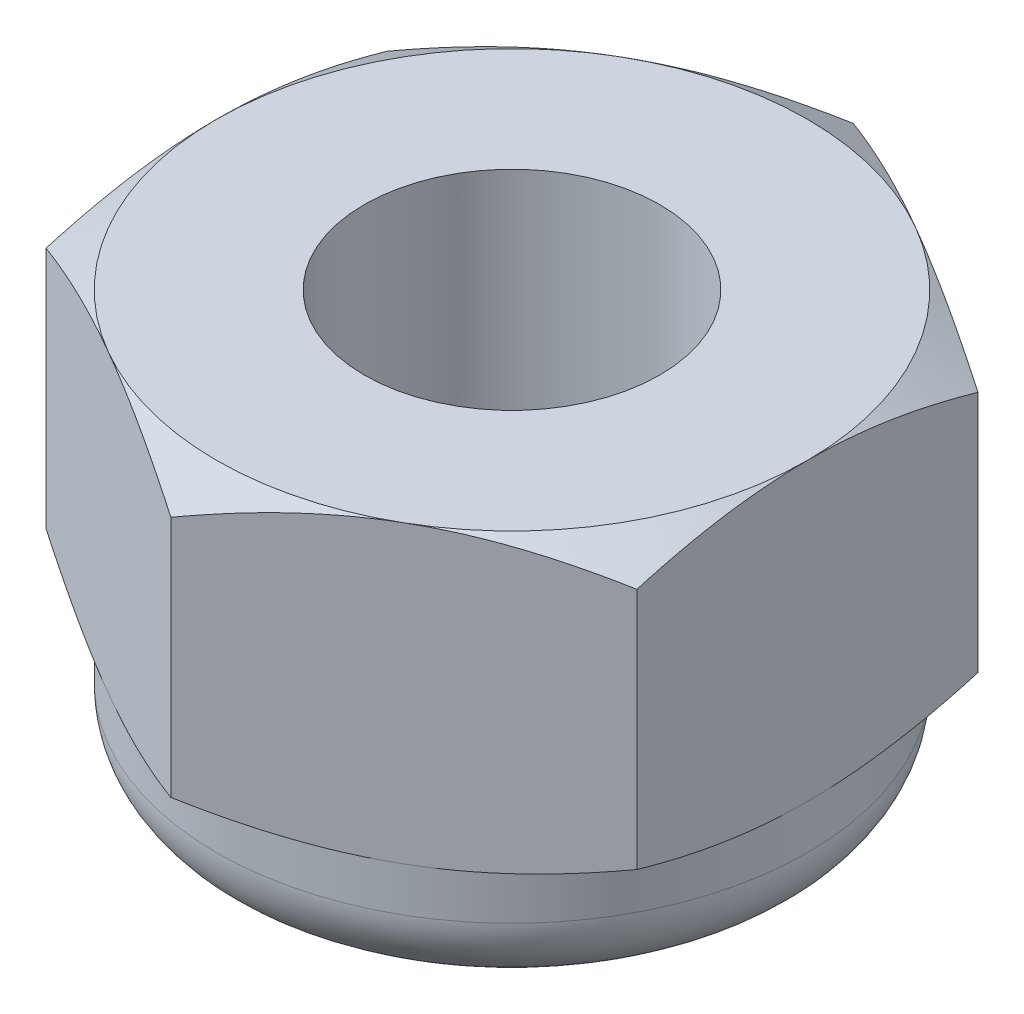
ISO-10303-21;
HEADER;
FILE_DESCRIPTION(('STEP AP214'),'2;1');
FILE_NAME('part.step','',(''),(''),'','','');
FILE_SCHEMA(('AUTOMOTIVE_DESIGN { 1 0 10303 214 1 1 1 1 }'));
ENDSEC;
DATA;
#1=APPLICATION_CONTEXT('core data for automotive mechanical design processes');
#2=APPLICATION_PROTOCOL_DEFINITION('international standard','automotive_design',2000,#1);
#3=PRODUCT_CONTEXT('',#1,'mechanical');
#4=PRODUCT('Part','Part','',(#3));
#5=PRODUCT_RELATED_PRODUCT_CATEGORY('part','',(#4));
#6=PRODUCT_DEFINITION_FORMATION('','',#4);
#7=PRODUCT_DEFINITION_CONTEXT('part definition',#1,'design');
#8=PRODUCT_DEFINITION('design','',#6,#7);
#9=PRODUCT_DEFINITION_SHAPE('','',#8);
#10=(LENGTH_UNIT() NAMED_UNIT(*) SI_UNIT(.MILLI.,.METRE.));
#11=(NAMED_UNIT(*) PLANE_ANGLE_UNIT() SI_UNIT($,.RADIAN.));
#12=(NAMED_UNIT(*) SI_UNIT($,.STERADIAN.) SOLID_ANGLE_UNIT());
#13=UNCERTAINTY_MEASURE_WITH_UNIT(LENGTH_MEASURE(1.E-05),#10,'distance_accuracy_value','');
#14=(GEOMETRIC_REPRESENTATION_CONTEXT(3) GLOBAL_UNCERTAINTY_ASSIGNED_CONTEXT((#13)) GLOBAL_UNIT_ASSIGNED_CONTEXT((#10,
#11,#12)) REPRESENTATION_CONTEXT('',''));
#15=CARTESIAN_POINT('',(0.,0.,0.));
#16=DIRECTION('',(0.,0.,1.));
#17=DIRECTION('',(1.,0.,0.));
#18=AXIS2_PLACEMENT_3D('',#15,#16,#17);
#19=CARTESIAN_POINT('',(2.,2.,1.15470053837925));
#20=DIRECTION('',(-1.,0.,0.));
#21=DIRECTION('',(0.,0.,1.));
#22=AXIS2_PLACEMENT_3D('',#19,#20,#21);
#23=PLANE('',#22);
#24=CARTESIAN_POINT('',(2.,0.978756095407433,-3.10723536680844));
#25=CARTESIAN_POINT('',(2.,0.936330863332912,-3.01982291823219));
#26=CARTESIAN_POINT('',(2.,0.89431086317883,-2.93221037878738));
#27=CARTESIAN_POINT('',(2.,0.811309169030377,-2.75647870840016));
#28=CARTESIAN_POINT('',(2.,0.77032763769453,-2.66835950071652));
#29=CARTESIAN_POINT('',(2.,0.689425807572109,-2.49105688446661));
#30=CARTESIAN_POINT('',(2.,0.649512450329226,-2.40187029759473));
#31=CARTESIAN_POINT('',(2.,0.57131209474233,-2.22278956266895));
#32=CARTESIAN_POINT('',(2.,0.533025019861076,-2.13289544814977));
#33=CARTESIAN_POINT('',(2.,0.457311353038221,-1.94935956345824));
#34=CARTESIAN_POINT('',(2.,0.419951688675203,-1.85569003285613));
#35=CARTESIAN_POINT('',(2.,0.34804642812102,-1.66725722619784));
#36=CARTESIAN_POINT('',(2.,0.313501146844893,-1.57249382909434));
#37=CARTESIAN_POINT('',(2.,0.248127262347396,-1.3818979783052));
#38=CARTESIAN_POINT('',(2.,0.217291190182717,-1.28606811236179));
#39=CARTESIAN_POINT('',(2.,0.16032134999564,-1.09303393169062));
#40=CARTESIAN_POINT('',(2.,0.13418610741452,-0.995830058317725));
#41=CARTESIAN_POINT('',(2.,0.088004663821854,-0.800519631578303));
#42=CARTESIAN_POINT('',(2.,0.0679260461447405,-0.702420887609314));
#43=CARTESIAN_POINT('',(2.,0.0349927806492822,-0.504998657700061));
#44=CARTESIAN_POINT('',(2.,0.0221374160431476,-0.405675294282897));
#45=CARTESIAN_POINT('',(2.,0.00484760332888601,-0.207596358324772));
#46=CARTESIAN_POINT('',(2.,0.000304399832631512,-0.108850556214251));
#47=CARTESIAN_POINT('',(2.,-0.00027499053746382,0.0886636690413114));
#48=CARTESIAN_POINT('',(2.,0.00368903604532294,0.187432092691779));
#49=CARTESIAN_POINT('',(2.,0.0230279822465883,0.42400790895349));
#50=CARTESIAN_POINT('',(2.,0.0423603458166526,0.561494039281412));
#51=CARTESIAN_POINT('',(2.,0.0941420038673285,0.833973970325345));
#52=CARTESIAN_POINT('',(2.,0.126603821944875,0.968965262409071));
#53=CARTESIAN_POINT('',(2.,0.201944047960998,1.23927661564325));
#54=CARTESIAN_POINT('',(2.,0.245044073308442,1.37453334872187));
#55=CARTESIAN_POINT('',(2.,0.314931252126183,1.57552896056492));
#56=CARTESIAN_POINT('',(2.,0.339097251406265,1.6422062420081));
#57=CARTESIAN_POINT('',(2.,0.388899908585125,1.77500960513522));
#58=CARTESIAN_POINT('',(2.,0.414536540528148,1.84113569652374));
#59=CARTESIAN_POINT('',(2.,0.481768746714614,2.0098882556886));
#60=CARTESIAN_POINT('',(2.,0.524243277066455,2.11216361209732));
#61=CARTESIAN_POINT('',(2.,0.611466108883442,2.31574315039746));
#62=CARTESIAN_POINT('',(2.,0.656214597675463,2.41704725145785));
#63=CARTESIAN_POINT('',(2.,0.793084875164524,2.7198353856836));
#64=CARTESIAN_POINT('',(2.,0.887808948992072,2.9201404776794));
#65=CARTESIAN_POINT('',(2.,1.08164958397818,3.31892342337664));
#66=CARTESIAN_POINT('',(2.,1.1807719397507,3.51739842382533));
#67=CARTESIAN_POINT('',(2.,1.38182194200768,3.91287779117342));
#68=CARTESIAN_POINT('',(2.,1.48374912228986,4.10988239563614));
#69=CARTESIAN_POINT('',(2.,1.67962496575455,4.48394528386546));
#70=CARTESIAN_POINT('',(2.,1.77339629287174,4.66109678041009));
#71=CARTESIAN_POINT('',(2.,1.96210959651939,5.01478564385389));
#72=CARTESIAN_POINT('',(2.,2.05705162979441,5.19132298044855));
#73=CARTESIAN_POINT('',(2.,2.24753342574158,5.54340746059359));
#74=CARTESIAN_POINT('',(2.,2.34307063024195,5.71895599016192));
#75=CARTESIAN_POINT('',(2.,2.53482345312968,6.06966713420134));
#76=CARTESIAN_POINT('',(2.,2.63103902598617,6.24482977355625));
#77=CARTESIAN_POINT('',(2.,2.72750366313233,6.41985423406967));
#78=B_SPLINE_CURVE_WITH_KNOTS('',3,(#24,#25,#26,#27,#28,#29,#30,#31,#32,#33,#34,#35,#36,#37,#38,
#39,#40,#41,#42,#43,#44,#45,#46,#47,#48,#49,#50,#51,#52,#53,#54,#55,#56,#57,#58,#59,#60,#61,#62,
#63,#64,#65,#66,#67,#68,#69,#70,#71,#72,#73,#74,#75,#76,#77),.UNSPECIFIED.,.F.,.F.,(4,2,2,2,2,2,
2,2,2,2,2,2,2,2,2,2,2,2,2,2,2,2,2,2,2,2,4),(0.,0.291495438255313,0.583036255581611,
0.876154468393304,1.16925887095091,1.47175908410079,1.77429309911686,2.07620734845282,
2.37802672737343,2.67820079177808,2.97834506363382,3.27453340260849,3.57072917339146,
3.98638730667862,4.40244285615798,4.8280307744903,5.04078368935428,5.25353285041585,
5.58572764769847,5.91794985542651,6.58257182862605,7.24809705005278,7.91351231191618,
8.51482375464892,9.11616445863758,9.71574753203119,10.3152907384778),.UNSPECIFIED.);
#79=CARTESIAN_POINT('',(2.,0.178632794953899,-1.15470053837953));
#80=VERTEX_POINT('',#79);
#81=CARTESIAN_POINT('',(2.,0.,0.));
#82=VERTEX_POINT('',#81);
#83=EDGE_CURVE('E150',#80,#82,#78,.T.);
#84=ORIENTED_EDGE('',*,*,#83,.F.);
#85=DIRECTION('',(0.,-1.,0.));
#86=VECTOR('',#85,1.);
#87=CARTESIAN_POINT('',(2.,2.,-1.15470053837925));
#88=LINE('',#87,#86);
#89=CARTESIAN_POINT('',(2.,1.82136720504592,-1.15470053837925));
#90=VERTEX_POINT('',#89);
#91=EDGE_CURVE('E159',#90,#80,#88,.T.);
#92=ORIENTED_EDGE('',*,*,#91,.F.);
#93=CARTESIAN_POINT('',(2.,1.02124390459258,-3.10723536680844));
#94=CARTESIAN_POINT('',(2.,1.0636691366671,-3.01982291823219));
#95=CARTESIAN_POINT('',(2.,1.10568913682119,-2.93221037878738));
#96=CARTESIAN_POINT('',(2.,1.18869083096964,-2.75647870840016));
#97=CARTESIAN_POINT('',(2.,1.22967236230548,-2.66835950071652));
#98=CARTESIAN_POINT('',(2.,1.3105741924279,-2.49105688446661));
#99=CARTESIAN_POINT('',(2.,1.35048754967079,-2.40187029759472));
#100=CARTESIAN_POINT('',(2.,1.42868790525768,-2.22278956266895));
#101=CARTESIAN_POINT('',(2.,1.46697498013893,-2.13289544814976));
#102=CARTESIAN_POINT('',(2.,1.54268864696179,-1.94935956345823));
#103=CARTESIAN_POINT('',(2.,1.58004831132481,-1.85569003285612));
#104=CARTESIAN_POINT('',(2.,1.65195357187899,-1.66725722619784));
#105=CARTESIAN_POINT('',(2.,1.68649885315511,-1.57249382909433));
#106=CARTESIAN_POINT('',(2.,1.75187273765261,-1.3818979783052));
#107=CARTESIAN_POINT('',(2.,1.78270880981729,-1.28606811236179));
#108=CARTESIAN_POINT('',(2.,1.83967865000436,-1.09303393169062));
#109=CARTESIAN_POINT('',(2.,1.86581389258548,-0.995830058317724));
#110=CARTESIAN_POINT('',(2.,1.91199533617815,-0.800519631578301));
#111=CARTESIAN_POINT('',(2.,1.93207395385526,-0.702420887609313));
#112=CARTESIAN_POINT('',(2.,1.96500721935072,-0.50499865770006));
#113=CARTESIAN_POINT('',(2.,1.97786258395685,-0.405675294282897));
#114=CARTESIAN_POINT('',(2.,1.99515239667111,-0.207596358324772));
#115=CARTESIAN_POINT('',(2.,1.99969560016737,-0.108850556214251));
#116=CARTESIAN_POINT('',(2.,2.00027499053746,0.0886636690413102));
#117=CARTESIAN_POINT('',(2.,1.99631096395468,0.187432092691778));
#118=CARTESIAN_POINT('',(2.,1.97697201775341,0.424007908953491));
#119=CARTESIAN_POINT('',(2.,1.95763965418335,0.561494039281416));
#120=CARTESIAN_POINT('',(2.,1.90585799613267,0.833973970325356));
#121=CARTESIAN_POINT('',(2.,1.87339617805512,0.968965262409084));
#122=CARTESIAN_POINT('',(2.,1.798055952039,1.23927661564327));
#123=CARTESIAN_POINT('',(2.,1.75495592669156,1.37453334872189));
#124=CARTESIAN_POINT('',(2.,1.68506874787381,1.57552896056494));
#125=CARTESIAN_POINT('',(2.,1.66090274859373,1.64220624200813));
#126=CARTESIAN_POINT('',(2.,1.61110009141487,1.77500960513525));
#127=CARTESIAN_POINT('',(2.,1.58546345947185,1.84113569652377));
#128=CARTESIAN_POINT('',(2.,1.51823125328538,2.00988825568864));
#129=CARTESIAN_POINT('',(2.,1.47575672293354,2.11216361209735));
#130=CARTESIAN_POINT('',(2.,1.38853389111655,2.31574315039749));
#131=CARTESIAN_POINT('',(2.,1.34378540232453,2.41704725145788));
#132=CARTESIAN_POINT('',(2.,1.20691512483548,2.71983538568363));
#133=CARTESIAN_POINT('',(2.,1.11219105100793,2.92014047767944));
#134=CARTESIAN_POINT('',(2.,0.918350416021822,3.31892342337667));
#135=CARTESIAN_POINT('',(2.,0.8192280602493,3.51739842382536));
#136=CARTESIAN_POINT('',(2.,0.618178057992325,3.91287779117345));
#137=CARTESIAN_POINT('',(2.,0.516250877710148,4.10988239563617));
#138=CARTESIAN_POINT('',(2.,0.320375034245468,4.48394528386549));
#139=CARTESIAN_POINT('',(2.,0.226603707128277,4.66109678041012));
#140=CARTESIAN_POINT('',(2.,0.0378904034806254,5.01478564385392));
#141=CARTESIAN_POINT('',(2.,-0.0570516297943871,5.19132298044858));
#142=CARTESIAN_POINT('',(2.,-0.247533425741555,5.54340746059362));
#143=CARTESIAN_POINT('',(2.,-0.343070630241926,5.71895599016195));
#144=CARTESIAN_POINT('',(2.,-0.534823453129656,6.06966713420137));
#145=CARTESIAN_POINT('',(2.,-0.631039025986142,6.24482977355628));
#146=CARTESIAN_POINT('',(2.,-0.727503663132301,6.41985423406971));
#147=B_SPLINE_CURVE_WITH_KNOTS('',3,(#93,#94,#95,#96,#97,#98,#99,#100,#101,#102,#103,#104,#105,
#106,#107,#108,#109,#110,#111,#112,#113,#114,#115,#116,#117,#118,#119,#120,#121,#122,#123,#124,
#125,#126,#127,#128,#129,#130,#131,#132,#133,#134,#135,#136,#137,#138,#139,#140,#141,#142,#143,
#144,#145,#146),.UNSPECIFIED.,.F.,.F.,(4,2,2,2,2,2,2,2,2,2,2,2,2,2,2,2,2,2,2,2,2,2,2,2,2,2,4),
(0.,0.291495438255313,0.583036255581611,0.876154468393303,1.16925887095091,1.47175908410079,
1.77429309911686,2.07620734845282,2.37802672737343,2.67820079177807,2.97834506363381,
3.27453340260848,3.57072917339145,3.98638730667862,4.40244285615799,4.82803077449032,
5.0407836893543,5.25353285041588,5.5857276476985,5.91794985542653,6.58257182862607,
7.24809705005279,7.91351231191619,8.51482375464894,9.11616445863759,9.7157475320312,
10.3152907384778),.UNSPECIFIED.);
#148=CARTESIAN_POINT('',(2.,2.,0.));
#149=VERTEX_POINT('',#148);
#150=EDGE_CURVE('E224',#149,#90,#147,.F.);
#151=ORIENTED_EDGE('',*,*,#150,.F.);
#152=CARTESIAN_POINT('',(2.,1.82136720504592,1.15470053837925));
#153=VERTEX_POINT('',#152);
#154=EDGE_CURVE('E231',#153,#149,#147,.F.);
#155=ORIENTED_EDGE('',*,*,#154,.F.);
#156=DIRECTION('',(0.,-1.,0.));
#157=VECTOR('',#156,1.);
#158=CARTESIAN_POINT('',(2.,2.,1.15470053837925));
#159=LINE('',#158,#157);
#160=CARTESIAN_POINT('',(2.,0.178632794954083,1.15470053837925));
#161=VERTEX_POINT('',#160);
#162=EDGE_CURVE('E242',#153,#161,#159,.T.);
#163=ORIENTED_EDGE('',*,*,#162,.T.);
#164=EDGE_CURVE('E214',#82,#161,#78,.T.);
#165=ORIENTED_EDGE('',*,*,#164,.F.);
#166=EDGE_LOOP('',(#84,#92,#151,#155,#163,#165));
#167=FACE_BOUND('',#166,.T.);
#168=ADVANCED_FACE('F38',(#167),#23,.F.);
#169=CARTESIAN_POINT('',(2.,2.,-1.15470053837925));
#170=DIRECTION('',(-0.5,0.,0.866025403784439));
#171=DIRECTION('',(0.866025403784439,0.,0.5));
#172=AXIS2_PLACEMENT_3D('',#169,#170,#171);
#173=PLANE('',#172);
#174=CARTESIAN_POINT('',(-0.000199999999999645,0.1786994666205,-2.30951654681234));
#175=CARTESIAN_POINT('',(0.0876912629000605,0.14938953610068,-2.25877250251758));
#176=CARTESIAN_POINT('',(0.176341194473592,0.122732851980468,-2.20759044065996));
#177=CARTESIAN_POINT('',(0.355176246997803,0.0762024910207222,-2.10433997494456));
#178=CARTESIAN_POINT('',(0.445364546505037,0.0563452763827803,-2.0522697359463));
#179=CARTESIAN_POINT('',(0.624623385763307,0.0254334640232535,-1.94877459684592));
#180=CARTESIAN_POINT('',(0.713666338226305,0.0141731515985319,-1.89736562427197));
#181=CARTESIAN_POINT('',(0.892171397785044,0.000728662594642558,-1.79430568008402));
#182=CARTESIAN_POINT('',(0.981632855703959,-0.00146664504653098,-1.74265508327244));
#183=CARTESIAN_POINT('',(1.1488083535488,0.00309098933064971,-1.64613626458981));
#184=CARTESIAN_POINT('',(1.22654737026578,0.00872487468701545,-1.60125362236173));
#185=CARTESIAN_POINT('',(1.38151891453613,0.0265838952608293,-1.51178075956051));
#186=CARTESIAN_POINT('',(1.4587509057412,0.0388151360234405,-1.46719084864821));
#187=CARTESIAN_POINT('',(1.6140421864822,0.0693934368676112,-1.37753338590959));
#188=CARTESIAN_POINT('',(1.69208181310738,0.0878701670657173,-1.33247718647009));
#189=CARTESIAN_POINT('',(1.84699686569213,0.129805518212857,-1.24303693915875));
#190=CARTESIAN_POINT('',(1.92387427762312,0.153254280492315,-1.1986517446858));
#191=CARTESIAN_POINT('',(2.0002,0.178699466620499,-1.15458506832541));
#192=B_SPLINE_CURVE_WITH_KNOTS('',3,(#174,#175,#176,#177,#178,#179,#180,#181,#182,#183,#184,
#185,#186,#187,#188,#189,#190,#191),.UNSPECIFIED.,.F.,.F.,(4,2,2,2,2,2,2,2,4),(0.,
0.31703182469561,0.634825876346564,0.944753967652636,1.25430138000371,1.52387047293094,
1.79368946861028,2.06949491027634,2.34475850821472),.UNSPECIFIED.);
#193=CARTESIAN_POINT('',(0.,0.178632794954083,-2.3094010767585));
#194=VERTEX_POINT('',#193);
#195=CARTESIAN_POINT('',(1.,0.,-1.73205080756888));
#196=VERTEX_POINT('',#195);
#197=EDGE_CURVE('E137',#194,#196,#192,.T.);
#198=ORIENTED_EDGE('',*,*,#197,.F.);
#199=DIRECTION('',(0.,-1.,0.));
#200=VECTOR('',#199,1.);
#201=CARTESIAN_POINT('',(0.,2.,-2.3094010767585));
#202=LINE('',#201,#200);
#203=CARTESIAN_POINT('',(0.,1.82136720504592,-2.3094010767585));
#204=VERTEX_POINT('',#203);
#205=EDGE_CURVE('E254',#204,#194,#202,.T.);
#206=ORIENTED_EDGE('',*,*,#205,.F.);
#207=CARTESIAN_POINT('',(2.0002,1.8213005333795,-1.15458506832541));
#208=CARTESIAN_POINT('',(1.91230873709994,1.85061046389932,-1.20532911262018));
#209=CARTESIAN_POINT('',(1.82365880552641,1.87726714801953,-1.2565111744778));
#210=CARTESIAN_POINT('',(1.6448237530022,1.92379750897928,-1.35976164019319));
#211=CARTESIAN_POINT('',(1.55463545349496,1.94365472361722,-1.41183187919145));
#212=CARTESIAN_POINT('',(1.37537661423669,1.97456653597675,-1.51532701829183));
#213=CARTESIAN_POINT('',(1.2863336617737,1.98582684840147,-1.56673599086578));
#214=CARTESIAN_POINT('',(1.10782860221496,1.99927133740536,-1.66979593505373));
#215=CARTESIAN_POINT('',(1.01836714429604,2.00146664504653,-1.72144653186531));
#216=CARTESIAN_POINT('',(0.851191646451203,1.99690901066935,-1.81796535054794));
#217=CARTESIAN_POINT('',(0.773452629734217,1.99127512531298,-1.86284799277603));
#218=CARTESIAN_POINT('',(0.618481085463868,1.97341610473917,-1.95232085557725));
#219=CARTESIAN_POINT('',(0.541249094258803,1.96118486397656,-1.99691076648954));
#220=CARTESIAN_POINT('',(0.3859578135178,1.93060656313239,-2.08656822922816));
#221=CARTESIAN_POINT('',(0.307918186892621,1.91212983293428,-2.13162442866767));
#222=CARTESIAN_POINT('',(0.153003134307866,1.87019448178714,-2.221064675979));
#223=CARTESIAN_POINT('',(0.0761257223768802,1.84674571950769,-2.26544987045196));
#224=CARTESIAN_POINT('',(-0.000199999999999858,1.8213005333795,-2.30951654681234));
#225=B_SPLINE_CURVE_WITH_KNOTS('',3,(#207,#208,#209,#210,#211,#212,#213,#214,#215,#216,#217,
#218,#219,#220,#221,#222,#223,#224),.UNSPECIFIED.,.F.,.F.,(4,2,2,2,2,2,2,2,4),(0.,
0.317031824695609,0.634825876346562,0.944753967652634,1.25430138000371,1.52387047293094,
1.79368946861028,2.06949491027634,2.34475850821472),.UNSPECIFIED.);
#226=CARTESIAN_POINT('',(1.,2.,-1.73205080756888));
#227=VERTEX_POINT('',#226);
#228=EDGE_CURVE('E233',#227,#204,#225,.T.);
#229=ORIENTED_EDGE('',*,*,#228,.F.);
#230=EDGE_CURVE('E232',#90,#227,#225,.T.);
#231=ORIENTED_EDGE('',*,*,#230,.F.);
#232=ORIENTED_EDGE('',*,*,#91,.T.);
#233=EDGE_CURVE('E145',#196,#80,#192,.T.);
#234=ORIENTED_EDGE('',*,*,#233,.F.);
#235=EDGE_LOOP('',(#198,#206,#229,#231,#232,#234));
#236=FACE_BOUND('',#235,.T.);
#237=ADVANCED_FACE('F156',(#236),#173,.F.);
#238=CARTESIAN_POINT('',(0.,2.,-2.3094010767585));
#239=DIRECTION('',(0.5,0.,0.866025403784439));
#240=DIRECTION('',(0.866025403784439,0.,-0.5));
#241=AXIS2_PLACEMENT_3D('',#238,#239,#240);
#242=PLANE('',#241);
#243=CARTESIAN_POINT('',(-2.0002,0.1786994666205,-1.15458506832541));
#244=CARTESIAN_POINT('',(-1.91230873709994,0.149389536100681,-1.20532911262018));
#245=CARTESIAN_POINT('',(-1.82365880552641,0.122732851980468,-1.2565111744778));
#246=CARTESIAN_POINT('',(-1.6448237530022,0.0762024910207224,-1.35976164019319));
#247=CARTESIAN_POINT('',(-1.55463545349496,0.0563452763827804,-1.41183187919145));
#248=CARTESIAN_POINT('',(-1.37537661423669,0.0254334640232536,-1.51532701829183));
#249=CARTESIAN_POINT('',(-1.2863336617737,0.0141731515985321,-1.56673599086578));
#250=CARTESIAN_POINT('',(-1.10782860221496,0.000728662594642656,-1.66979593505373));
#251=CARTESIAN_POINT('',(-1.01836714429604,-0.00146664504653101,-1.72144653186531));
#252=CARTESIAN_POINT('',(-0.851191646451201,0.00309098933064974,-1.81796535054794));
#253=CARTESIAN_POINT('',(-0.773452629734215,0.00872487468701564,-1.86284799277603));
#254=CARTESIAN_POINT('',(-0.618481085463866,0.0265838952608296,-1.95232085557725));
#255=CARTESIAN_POINT('',(-0.541249094258801,0.0388151360234406,-1.99691076648954));
#256=CARTESIAN_POINT('',(-0.385957813517798,0.0693934368676112,-2.08656822922816));
#257=CARTESIAN_POINT('',(-0.30791818689262,0.0878701670657173,-2.13162442866767));
#258=CARTESIAN_POINT('',(-0.153003134307865,0.129805518212858,-2.221064675979));
#259=CARTESIAN_POINT('',(-0.0761257223768792,0.153254280492315,-2.26544987045196));
#260=CARTESIAN_POINT('',(0.000200000000000784,0.1786994666205,-2.30951654681234));
#261=B_SPLINE_CURVE_WITH_KNOTS('',3,(#243,#244,#245,#246,#247,#248,#249,#250,#251,#252,#253,
#254,#255,#256,#257,#258,#259,#260),.UNSPECIFIED.,.F.,.F.,(4,2,2,2,2,2,2,2,4),(0.,
0.31703182469561,0.634825876346564,0.944753967652637,1.25430138000371,1.52387047293094,
1.79368946861028,2.06949491027634,2.34475850821472),.UNSPECIFIED.);
#262=CARTESIAN_POINT('',(-2.,0.178632794953899,-1.15470053837953));
#263=VERTEX_POINT('',#262);
#264=CARTESIAN_POINT('',(-0.999999999999999,0.,-1.73205080756888));
#265=VERTEX_POINT('',#264);
#266=EDGE_CURVE('E311',#263,#265,#261,.T.);
#267=ORIENTED_EDGE('',*,*,#266,.F.);
#268=DIRECTION('',(0.,-1.,0.));
#269=VECTOR('',#268,1.);
#270=CARTESIAN_POINT('',(-2.,2.,-1.15470053837925));
#271=LINE('',#270,#269);
#272=CARTESIAN_POINT('',(-2.,1.8213672050461,-1.15470053837953));
#273=VERTEX_POINT('',#272);
#274=EDGE_CURVE('E251',#273,#263,#271,.T.);
#275=ORIENTED_EDGE('',*,*,#274,.F.);
#276=CARTESIAN_POINT('',(0.000200000000000387,1.8213005333795,-2.30951654681234));
#277=CARTESIAN_POINT('',(-0.0876912629000595,1.85061046389932,-2.25877250251758));
#278=CARTESIAN_POINT('',(-0.176341194473591,1.87726714801953,-2.20759044065996));
#279=CARTESIAN_POINT('',(-0.355176246997801,1.92379750897928,-2.10433997494456));
#280=CARTESIAN_POINT('',(-0.445364546505036,1.94365472361722,-2.05226973594631));
#281=CARTESIAN_POINT('',(-0.624623385763305,1.97456653597675,-1.94877459684592));
#282=CARTESIAN_POINT('',(-0.713666338226303,1.98582684840147,-1.89736562427197));
#283=CARTESIAN_POINT('',(-0.892171397785042,1.99927133740536,-1.79430568008402));
#284=CARTESIAN_POINT('',(-0.981632855703957,2.00146664504653,-1.74265508327244));
#285=CARTESIAN_POINT('',(-1.1488083535488,1.99690901066935,-1.64613626458981));
#286=CARTESIAN_POINT('',(-1.22654737026578,1.99127512531299,-1.60125362236173));
#287=CARTESIAN_POINT('',(-1.38151891453613,1.97341610473917,-1.51178075956051));
#288=CARTESIAN_POINT('',(-1.4587509057412,1.96118486397656,-1.46719084864821));
#289=CARTESIAN_POINT('',(-1.6140421864822,1.93060656313239,-1.37753338590959));
#290=CARTESIAN_POINT('',(-1.69208181310738,1.91212983293428,-1.33247718647009));
#291=CARTESIAN_POINT('',(-1.84699686569213,1.87019448178714,-1.24303693915875));
#292=CARTESIAN_POINT('',(-1.92387427762312,1.84674571950769,-1.1986517446858));
#293=CARTESIAN_POINT('',(-2.0002,1.8213005333795,-1.15458506832541));
#294=B_SPLINE_CURVE_WITH_KNOTS('',3,(#276,#277,#278,#279,#280,#281,#282,#283,#284,#285,#286,
#287,#288,#289,#290,#291,#292,#293),.UNSPECIFIED.,.F.,.F.,(4,2,2,2,2,2,2,2,4),(0.,
0.317031824695609,0.634825876346563,0.944753967652634,1.25430138000371,1.52387047293094,
1.79368946861028,2.06949491027634,2.34475850821472),.UNSPECIFIED.);
#295=CARTESIAN_POINT('',(-1.,2.,-1.73205080756888));
#296=VERTEX_POINT('',#295);
#297=EDGE_CURVE('E293',#296,#273,#294,.T.);
#298=ORIENTED_EDGE('',*,*,#297,.F.);
#299=EDGE_CURVE('E298',#204,#296,#294,.T.);
#300=ORIENTED_EDGE('',*,*,#299,.F.);
#301=ORIENTED_EDGE('',*,*,#205,.T.);
#302=EDGE_CURVE('E139',#265,#194,#261,.T.);
#303=ORIENTED_EDGE('',*,*,#302,.F.);
#304=EDGE_LOOP('',(#267,#275,#298,#300,#301,#303));
#305=FACE_BOUND('',#304,.T.);
#306=ADVANCED_FACE('F299',(#305),#242,.F.);
#307=CARTESIAN_POINT('',(-2.,2.,-1.15470053837925));
#308=DIRECTION('',(1.,0.,0.));
#309=DIRECTION('',(0.,0.,-1.));
#310=AXIS2_PLACEMENT_3D('',#307,#308,#309);
#311=PLANE('',#310);
#312=CARTESIAN_POINT('',(-2.,0.97875609535379,-3.10723536669795));
#313=CARTESIAN_POINT('',(-2.,0.936330863281514,-3.01982291812541));
#314=CARTESIAN_POINT('',(-2.,0.894310863129675,-2.93221037868432));
#315=CARTESIAN_POINT('',(-2.,0.811309168985699,-2.75647870830454));
#316=CARTESIAN_POINT('',(-2.,0.770327637652085,-2.66835950062463));
#317=CARTESIAN_POINT('',(-2.,0.689425807534132,-2.49105688438224));
#318=CARTESIAN_POINT('',(-2.,0.649512450293482,-2.40187029751414));
#319=CARTESIAN_POINT('',(-2.,0.571312094711017,-2.22278956259597));
#320=CARTESIAN_POINT('',(-2.,0.533025019831961,-2.1328954480806));
#321=CARTESIAN_POINT('',(-2.,0.457311353013554,-1.94935956339698));
#322=CARTESIAN_POINT('',(-2.,0.419951688652782,-1.85569003279897));
#323=CARTESIAN_POINT('',(-2.,0.348046428102969,-1.66725722614894));
#324=CARTESIAN_POINT('',(-2.,0.313501146828967,-1.5724938290496));
#325=CARTESIAN_POINT('',(-2.,0.248127262335514,-1.38189797826887));
#326=CARTESIAN_POINT('',(-2.,0.217291190172755,-1.2860681123297));
#327=CARTESIAN_POINT('',(-2.,0.160321349989199,-1.09303393166713));
#328=CARTESIAN_POINT('',(-2.,0.13418610740968,-0.995830058298589));
#329=CARTESIAN_POINT('',(-2.,0.0880046638202398,-0.800519631570149));
#330=CARTESIAN_POINT('',(-2.,0.0679260461446231,-0.702420887607818));
#331=CARTESIAN_POINT('',(-2.,0.0349927806511484,-0.504998657712037));
#332=CARTESIAN_POINT('',(-2.,0.0221374160455017,-0.405675294301687));
#333=CARTESIAN_POINT('',(-2.,0.00484760333100355,-0.207596358357075));
#334=CARTESIAN_POINT('',(-2.,0.000304399834046624,-0.108850556253253));
#335=CARTESIAN_POINT('',(-2.,-0.000274990538612278,0.0886636689890198));
#336=CARTESIAN_POINT('',(-2.,0.00368903604231298,0.187432092632897));
#337=CARTESIAN_POINT('',(-2.,0.0230279822384204,0.424007908884414));
#338=CARTESIAN_POINT('',(-2.,0.0423603458053599,0.561494039208797));
#339=CARTESIAN_POINT('',(-2.,0.0941420038497061,0.833973970245913));
#340=CARTESIAN_POINT('',(-2.,0.126603821924048,0.968965262326359));
#341=CARTESIAN_POINT('',(-2.,0.201944047933828,1.23927661555394));
#342=CARTESIAN_POINT('',(-2.,0.245044073278133,1.37453334862926));
#343=CARTESIAN_POINT('',(-2.,0.314931252091323,1.57552896046736));
#344=CARTESIAN_POINT('',(-2.,0.339097251369916,1.64220624190891));
#345=CARTESIAN_POINT('',(-2.,0.388899908545846,1.77500960503275));
#346=CARTESIAN_POINT('',(-2.,0.414536540487429,1.84113569641962));
#347=CARTESIAN_POINT('',(-2.,0.481768746671532,2.00988825558346));
#348=CARTESIAN_POINT('',(-2.,0.524243277022575,2.11216361199275));
#349=CARTESIAN_POINT('',(-2.,0.611466108838181,2.31574315029396));
#350=CARTESIAN_POINT('',(-2.,0.656214597629619,2.41704725135485));
#351=CARTESIAN_POINT('',(-2.,0.793084875117167,2.71983538558203));
#352=CARTESIAN_POINT('',(-2.,0.887808948944018,2.92014047757868));
#353=CARTESIAN_POINT('',(-2.,1.08164958392909,3.31892342327748));
#354=CARTESIAN_POINT('',(-2.,1.18077193970127,3.51739842372691));
#355=CARTESIAN_POINT('',(-2.,1.38182194195775,3.91287779107638));
#356=CARTESIAN_POINT('',(-2.,1.48374912223979,4.10988239553973));
#357=CARTESIAN_POINT('',(-2.,1.67962496570403,4.4839452837697));
#358=CARTESIAN_POINT('',(-2.,1.77339629282093,4.66109678031435));
#359=CARTESIAN_POINT('',(-2.,1.96210959646804,5.01478564375816));
#360=CARTESIAN_POINT('',(-2.,2.05705162974282,5.19132298035281));
#361=CARTESIAN_POINT('',(-2.,2.24753342568951,5.54340746049773));
#362=CARTESIAN_POINT('',(-2.,2.34307063018964,5.71895599006594));
#363=CARTESIAN_POINT('',(-2.,2.53482345307692,6.06966713410512));
#364=CARTESIAN_POINT('',(-2.,2.63103902593319,6.24482977345991));
#365=CARTESIAN_POINT('',(-2.,2.72750366307915,6.41985423397319));
#366=B_SPLINE_CURVE_WITH_KNOTS('',3,(#312,#313,#314,#315,#316,#317,#318,#319,#320,#321,#322,
#323,#324,#325,#326,#327,#328,#329,#330,#331,#332,#333,#334,#335,#336,#337,#338,#339,#340,#341,
#342,#343,#344,#345,#346,#347,#348,#349,#350,#351,#352,#353,#354,#355,#356,#357,#358,#359,#360,
#361,#362,#363,#364,#365),.UNSPECIFIED.,.F.,.F.,(4,2,2,2,2,2,2,2,2,2,2,2,2,2,2,2,2,2,2,2,2,2,2,
2,2,2,4),(0.,0.291495438242345,0.583036255555676,0.876154468354256,1.16925887089875,
1.47175908403472,1.77429309903688,2.07620734835897,2.37802672726573,2.67820079164995,
2.9783450634853,3.27453340244007,3.57072917320313,3.98638730647848,4.40244285594601,
4.828030774266,5.04078368912382,5.25353285017925,5.58572764746253,5.91794985519123,
6.58257182839213,7.24809704982037,7.91351231168526,8.51482375441764,9.11616445840593,
9.7157475317989,10.3152907382448),.UNSPECIFIED.);
#367=CARTESIAN_POINT('',(-2.,0.178632794954083,1.15470053837925));
#368=VERTEX_POINT('',#367);
#369=CARTESIAN_POINT('',(-2.,0.,0.));
#370=VERTEX_POINT('',#369);
#371=EDGE_CURVE('E160',#368,#370,#366,.F.);
#372=ORIENTED_EDGE('',*,*,#371,.F.);
#373=DIRECTION('',(0.,-1.,0.));
#374=VECTOR('',#373,1.);
#375=CARTESIAN_POINT('',(-2.,2.,1.15470053837925));
#376=LINE('',#375,#374);
#377=CARTESIAN_POINT('',(-2.,1.82136720504592,1.15470053837925));
#378=VERTEX_POINT('',#377);
#379=EDGE_CURVE('E248',#378,#368,#376,.T.);
#380=ORIENTED_EDGE('',*,*,#379,.F.);
#381=CARTESIAN_POINT('',(-2.,1.02124390464623,-3.10723536669795));
#382=CARTESIAN_POINT('',(-2.,1.0636691367185,-3.01982291812541));
#383=CARTESIAN_POINT('',(-2.,1.10568913687034,-2.93221037868432));
#384=CARTESIAN_POINT('',(-2.,1.18869083101432,-2.75647870830454));
#385=CARTESIAN_POINT('',(-2.,1.22967236234793,-2.66835950062463));
#386=CARTESIAN_POINT('',(-2.,1.31057419246588,-2.49105688438224));
#387=CARTESIAN_POINT('',(-2.,1.35048754970653,-2.40187029751414));
#388=CARTESIAN_POINT('',(-2.,1.42868790528899,-2.22278956259597));
#389=CARTESIAN_POINT('',(-2.,1.46697498016805,-2.1328954480806));
#390=CARTESIAN_POINT('',(-2.,1.54268864698646,-1.94935956339698));
#391=CARTESIAN_POINT('',(-2.,1.58004831134723,-1.85569003279897));
#392=CARTESIAN_POINT('',(-2.,1.65195357189704,-1.66725722614894));
#393=CARTESIAN_POINT('',(-2.,1.68649885317104,-1.5724938290496));
#394=CARTESIAN_POINT('',(-2.,1.75187273766449,-1.38189797826886));
#395=CARTESIAN_POINT('',(-2.,1.78270880982725,-1.2860681123297));
#396=CARTESIAN_POINT('',(-2.,1.8396786500108,-1.09303393166713));
#397=CARTESIAN_POINT('',(-2.,1.86581389259032,-0.995830058298588));
#398=CARTESIAN_POINT('',(-2.,1.91199533617976,-0.800519631570149));
#399=CARTESIAN_POINT('',(-2.,1.93207395385538,-0.702420887607818));
#400=CARTESIAN_POINT('',(-2.,1.96500721934885,-0.504998657712037));
#401=CARTESIAN_POINT('',(-2.,1.9778625839545,-0.405675294301688));
#402=CARTESIAN_POINT('',(-2.,1.995152396669,-0.207596358357077));
#403=CARTESIAN_POINT('',(-2.,1.99969560016595,-0.108850556253254));
#404=CARTESIAN_POINT('',(-2.,2.00027499053861,0.0886636689890182));
#405=CARTESIAN_POINT('',(-2.,1.99631096395769,0.187432092632895));
#406=CARTESIAN_POINT('',(-2.,1.97697201776158,0.424007908884414));
#407=CARTESIAN_POINT('',(-2.,1.95763965419464,0.5614940392088));
#408=CARTESIAN_POINT('',(-2.,1.90585799615029,0.833973970245921));
#409=CARTESIAN_POINT('',(-2.,1.87339617807595,0.96896526232637));
#410=CARTESIAN_POINT('',(-2.,1.79805595206617,1.23927661555396));
#411=CARTESIAN_POINT('',(-2.,1.75495592672187,1.37453334862928));
#412=CARTESIAN_POINT('',(-2.,1.68506874790867,1.57552896046739));
#413=CARTESIAN_POINT('',(-2.,1.66090274863008,1.64220624190894));
#414=CARTESIAN_POINT('',(-2.,1.61110009145415,1.77500960503277));
#415=CARTESIAN_POINT('',(-2.,1.58546345951257,1.84113569641965));
#416=CARTESIAN_POINT('',(-2.,1.51823125332846,2.00988825558349));
#417=CARTESIAN_POINT('',(-2.,1.47575672297742,2.11216361199278));
#418=CARTESIAN_POINT('',(-2.,1.38853389116182,2.31574315029399));
#419=CARTESIAN_POINT('',(-2.,1.34378540237038,2.41704725135488));
#420=CARTESIAN_POINT('',(-2.,1.20691512488283,2.71983538558207));
#421=CARTESIAN_POINT('',(-2.,1.11219105105598,2.92014047757871));
#422=CARTESIAN_POINT('',(-2.,0.918350416070917,3.31892342327751));
#423=CARTESIAN_POINT('',(-2.,0.819228060298738,3.51739842372694));
#424=CARTESIAN_POINT('',(-2.,0.618178058042253,3.91287779107641));
#425=CARTESIAN_POINT('',(-2.,0.516250877760224,4.10988239553976));
#426=CARTESIAN_POINT('',(-2.,0.320375034295978,4.48394528376973));
#427=CARTESIAN_POINT('',(-2.,0.226603707179087,4.66109678031438));
#428=CARTESIAN_POINT('',(-2.,0.0378904035319746,5.01478564375819));
#429=CARTESIAN_POINT('',(-2.,-0.057051629742799,5.19132298035284));
#430=CARTESIAN_POINT('',(-2.,-0.247533425689487,5.54340746049776));
#431=CARTESIAN_POINT('',(-2.,-0.343070630189615,5.71895599006598));
#432=CARTESIAN_POINT('',(-2.,-0.53482345307689,6.06966713410516));
#433=CARTESIAN_POINT('',(-2.,-0.631039025933165,6.24482977345994));
#434=CARTESIAN_POINT('',(-2.,-0.727503663079121,6.41985423397323));
#435=B_SPLINE_CURVE_WITH_KNOTS('',3,(#381,#382,#383,#384,#385,#386,#387,#388,#389,#390,#391,
#392,#393,#394,#395,#396,#397,#398,#399,#400,#401,#402,#403,#404,#405,#406,#407,#408,#409,#410,
#411,#412,#413,#414,#415,#416,#417,#418,#419,#420,#421,#422,#423,#424,#425,#426,#427,#428,#429,
#430,#431,#432,#433,#434),.UNSPECIFIED.,.F.,.F.,(4,2,2,2,2,2,2,2,2,2,2,2,2,2,2,2,2,2,2,2,2,2,2,
2,2,2,4),(0.,0.291495438242345,0.583036255555675,0.876154468354256,1.16925887089875,
1.47175908403472,1.77429309903688,2.07620734835897,2.37802672726572,2.67820079164995,
2.97834506348529,3.27453340244006,3.57072917320312,3.98638730647848,4.40244285594602,
4.82803077426602,5.04078368912384,5.25353285017927,5.58572764746255,5.91794985519125,
6.58257182839215,7.24809704982039,7.91351231168528,8.51482375441766,9.11616445840594,
9.71574753179891,10.3152907382448),.UNSPECIFIED.);
#436=CARTESIAN_POINT('',(-2.,2.,0.));
#437=VERTEX_POINT('',#436);
#438=EDGE_CURVE('E287',#437,#378,#435,.T.);
#439=ORIENTED_EDGE('',*,*,#438,.F.);
#440=EDGE_CURVE('E292',#273,#437,#435,.T.);
#441=ORIENTED_EDGE('',*,*,#440,.F.);
#442=ORIENTED_EDGE('',*,*,#274,.T.);
#443=EDGE_CURVE('E144',#370,#263,#366,.F.);
#444=ORIENTED_EDGE('',*,*,#443,.F.);
#445=EDGE_LOOP('',(#372,#380,#439,#441,#442,#444));
#446=FACE_BOUND('',#445,.T.);
#447=ADVANCED_FACE('F274',(#446),#311,.F.);
#448=CARTESIAN_POINT('',(-2.,2.,1.15470053837925));
#449=DIRECTION('',(0.5,0.,-0.866025403784439));
#450=DIRECTION('',(-0.866025403784439,0.,-0.5));
#451=AXIS2_PLACEMENT_3D('',#448,#449,#450);
#452=PLANE('',#451);
#453=CARTESIAN_POINT('',(0.000200000000000486,0.1786994666205,2.30951654681234));
#454=CARTESIAN_POINT('',(-0.0876912629000597,0.149389536100681,2.25877250251758));
#455=CARTESIAN_POINT('',(-0.176341194473591,0.122732851980468,2.20759044065995));
#456=CARTESIAN_POINT('',(-0.355176246997802,0.0762024910207222,2.10433997494456));
#457=CARTESIAN_POINT('',(-0.445364546505036,0.05634527638278,2.0522697359463));
#458=CARTESIAN_POINT('',(-0.624623385763306,0.0254334640232532,1.94877459684592));
#459=CARTESIAN_POINT('',(-0.713666338226304,0.0141731515985319,1.89736562427197));
#460=CARTESIAN_POINT('',(-0.892171397785043,0.000728662594642584,1.79430568008402));
#461=CARTESIAN_POINT('',(-0.981632855703958,-0.00146664504653125,1.74265508327244));
#462=CARTESIAN_POINT('',(-1.1488083535488,0.00309098933064937,1.64613626458981));
#463=CARTESIAN_POINT('',(-1.22654737026578,0.00872487468701528,1.60125362236172));
#464=CARTESIAN_POINT('',(-1.38151891453613,0.0265838952608292,1.51178075956051));
#465=CARTESIAN_POINT('',(-1.4587509057412,0.0388151360234402,1.46719084864821));
#466=CARTESIAN_POINT('',(-1.6140421864822,0.0693934368676109,1.37753338590959));
#467=CARTESIAN_POINT('',(-1.69208181310738,0.0878701670657172,1.33247718647009));
#468=CARTESIAN_POINT('',(-1.84699686569213,0.129805518212857,1.24303693915875));
#469=CARTESIAN_POINT('',(-1.92387427762312,0.153254280492315,1.1986517446858));
#470=CARTESIAN_POINT('',(-2.0002,0.178699466620499,1.15458506832541));
#471=B_SPLINE_CURVE_WITH_KNOTS('',3,(#453,#454,#455,#456,#457,#458,#459,#460,#461,#462,#463,
#464,#465,#466,#467,#468,#469,#470),.UNSPECIFIED.,.F.,.F.,(4,2,2,2,2,2,2,2,4),(0.,
0.317031824695611,0.634825876346564,0.944753967652637,1.25430138000371,1.52387047293094,
1.79368946861028,2.06949491027634,2.34475850821472),.UNSPECIFIED.);
#472=CARTESIAN_POINT('',(0.,0.178632794954083,2.3094010767585));
#473=VERTEX_POINT('',#472);
#474=CARTESIAN_POINT('',(-1.,0.,1.73205080756888));
#475=VERTEX_POINT('',#474);
#476=EDGE_CURVE('E207',#473,#475,#471,.T.);
#477=ORIENTED_EDGE('',*,*,#476,.F.);
#478=DIRECTION('',(0.,-1.,0.));
#479=VECTOR('',#478,1.);
#480=CARTESIAN_POINT('',(0.,2.,2.3094010767585));
#481=LINE('',#480,#479);
#482=CARTESIAN_POINT('',(0.,1.82136720504592,2.3094010767585));
#483=VERTEX_POINT('',#482);
#484=EDGE_CURVE('E245',#483,#473,#481,.T.);
#485=ORIENTED_EDGE('',*,*,#484,.F.);
#486=CARTESIAN_POINT('',(-2.0002,1.8213005333795,1.15458506832541));
#487=CARTESIAN_POINT('',(-1.91230873709994,1.85061046389932,1.20532911262018));
#488=CARTESIAN_POINT('',(-1.82365880552641,1.87726714801953,1.2565111744778));
#489=CARTESIAN_POINT('',(-1.6448237530022,1.92379750897928,1.35976164019319));
#490=CARTESIAN_POINT('',(-1.55463545349496,1.94365472361722,1.41183187919145));
#491=CARTESIAN_POINT('',(-1.3753766142367,1.97456653597675,1.51532701829183));
#492=CARTESIAN_POINT('',(-1.2863336617737,1.98582684840147,1.56673599086578));
#493=CARTESIAN_POINT('',(-1.10782860221496,1.99927133740536,1.66979593505373));
#494=CARTESIAN_POINT('',(-1.01836714429604,2.00146664504653,1.72144653186531));
#495=CARTESIAN_POINT('',(-0.851191646451203,1.99690901066935,1.81796535054794));
#496=CARTESIAN_POINT('',(-0.773452629734218,1.99127512531299,1.86284799277603));
#497=CARTESIAN_POINT('',(-0.618481085463868,1.97341610473917,1.95232085557725));
#498=CARTESIAN_POINT('',(-0.541249094258803,1.96118486397656,1.99691076648954));
#499=CARTESIAN_POINT('',(-0.3859578135178,1.93060656313239,2.08656822922816));
#500=CARTESIAN_POINT('',(-0.307918186892621,1.91212983293428,2.13162442866767));
#501=CARTESIAN_POINT('',(-0.153003134307865,1.87019448178714,2.221064675979));
#502=CARTESIAN_POINT('',(-0.0761257223768798,1.84674571950769,2.26544987045196));
#503=CARTESIAN_POINT('',(0.00020000000000052,1.8213005333795,2.30951654681234));
#504=B_SPLINE_CURVE_WITH_KNOTS('',3,(#486,#487,#488,#489,#490,#491,#492,#493,#494,#495,#496,
#497,#498,#499,#500,#501,#502,#503),.UNSPECIFIED.,.F.,.F.,(4,2,2,2,2,2,2,2,4),(0.,
0.317031824695609,0.634825876346562,0.944753967652634,1.25430138000371,1.52387047293094,
1.79368946861028,2.06949491027634,2.34475850821472),.UNSPECIFIED.);
#505=CARTESIAN_POINT('',(-1.,2.,1.73205080756888));
#506=VERTEX_POINT('',#505);
#507=EDGE_CURVE('E279',#506,#483,#504,.T.);
#508=ORIENTED_EDGE('',*,*,#507,.F.);
#509=EDGE_CURVE('E285',#378,#506,#504,.T.);
#510=ORIENTED_EDGE('',*,*,#509,.F.);
#511=ORIENTED_EDGE('',*,*,#379,.T.);
#512=EDGE_CURVE('E162',#475,#368,#471,.T.);
#513=ORIENTED_EDGE('',*,*,#512,.F.);
#514=EDGE_LOOP('',(#477,#485,#508,#510,#511,#513));
#515=FACE_BOUND('',#514,.T.);
#516=ADVANCED_FACE('F269',(#515),#452,.F.);
#517=CARTESIAN_POINT('',(0.,2.,2.3094010767585));
#518=DIRECTION('',(-0.5,0.,-0.866025403784439));
#519=DIRECTION('',(-0.866025403784439,0.,0.5));
#520=AXIS2_PLACEMENT_3D('',#517,#518,#519);
#521=PLANE('',#520);
#522=CARTESIAN_POINT('',(2.0002,0.178699466620499,1.15458506832541));
#523=CARTESIAN_POINT('',(1.91230873709994,0.149389536100681,1.20532911262018));
#524=CARTESIAN_POINT('',(1.82365880552641,0.122732851980468,1.2565111744778));
#525=CARTESIAN_POINT('',(1.6448237530022,0.0762024910207222,1.35976164019319));
#526=CARTESIAN_POINT('',(1.55463545349496,0.0563452763827801,1.41183187919145));
#527=CARTESIAN_POINT('',(1.37537661423669,0.0254334640232533,1.51532701829183));
#528=CARTESIAN_POINT('',(1.28633366177369,0.0141731515985319,1.56673599086578));
#529=CARTESIAN_POINT('',(1.10782860221496,0.000728662594642661,1.66979593505373));
#530=CARTESIAN_POINT('',(1.01836714429604,-0.00146664504653104,1.72144653186531));
#531=CARTESIAN_POINT('',(0.851191646451201,0.00309098933064976,1.81796535054794));
#532=CARTESIAN_POINT('',(0.773452629734215,0.00872487468701572,1.86284799277603));
#533=CARTESIAN_POINT('',(0.618481085463866,0.0265838952608297,1.95232085557725));
#534=CARTESIAN_POINT('',(0.541249094258801,0.0388151360234407,1.99691076648954));
#535=CARTESIAN_POINT('',(0.385957813517799,0.0693934368676112,2.08656822922816));
#536=CARTESIAN_POINT('',(0.30791818689262,0.0878701670657173,2.13162442866767));
#537=CARTESIAN_POINT('',(0.153003134307865,0.129805518212857,2.221064675979));
#538=CARTESIAN_POINT('',(0.0761257223768804,0.153254280492315,2.26544987045196));
#539=CARTESIAN_POINT('',(-0.000199999999999453,0.1786994666205,2.30951654681234));
#540=B_SPLINE_CURVE_WITH_KNOTS('',3,(#522,#523,#524,#525,#526,#527,#528,#529,#530,#531,#532,
#533,#534,#535,#536,#537,#538,#539),.UNSPECIFIED.,.F.,.F.,(4,2,2,2,2,2,2,2,4),(0.,
0.31703182469561,0.634825876346564,0.944753967652637,1.25430138000371,1.52387047293094,
1.79368946861028,2.06949491027634,2.34475850821472),.UNSPECIFIED.);
#541=CARTESIAN_POINT('',(1.,0.,1.73205080756888));
#542=VERTEX_POINT('',#541);
#543=EDGE_CURVE('E388',#161,#542,#540,.T.);
#544=ORIENTED_EDGE('',*,*,#543,.F.);
#545=ORIENTED_EDGE('',*,*,#162,.F.);
#546=CARTESIAN_POINT('',(-0.000199999999999553,1.8213005333795,2.30951654681234));
#547=CARTESIAN_POINT('',(0.0876912629000603,1.85061046389932,2.25877250251758));
#548=CARTESIAN_POINT('',(0.176341194473592,1.87726714801953,2.20759044065996));
#549=CARTESIAN_POINT('',(0.355176246997802,1.92379750897928,2.10433997494456));
#550=CARTESIAN_POINT('',(0.445364546505036,1.94365472361722,2.05226973594631));
#551=CARTESIAN_POINT('',(0.624623385763306,1.97456653597675,1.94877459684592));
#552=CARTESIAN_POINT('',(0.713666338226304,1.98582684840147,1.89736562427197));
#553=CARTESIAN_POINT('',(0.892171397785042,1.99927133740536,1.79430568008402));
#554=CARTESIAN_POINT('',(0.981632855703957,2.00146664504653,1.74265508327244));
#555=CARTESIAN_POINT('',(1.1488083535488,1.99690901066935,1.64613626458981));
#556=CARTESIAN_POINT('',(1.22654737026578,1.99127512531298,1.60125362236173));
#557=CARTESIAN_POINT('',(1.38151891453613,1.97341610473917,1.51178075956051));
#558=CARTESIAN_POINT('',(1.4587509057412,1.96118486397656,1.46719084864821));
#559=CARTESIAN_POINT('',(1.6140421864822,1.93060656313239,1.37753338590959));
#560=CARTESIAN_POINT('',(1.69208181310738,1.91212983293428,1.33247718647009));
#561=CARTESIAN_POINT('',(1.84699686569213,1.87019448178714,1.24303693915875));
#562=CARTESIAN_POINT('',(1.92387427762312,1.84674571950769,1.1986517446858));
#563=CARTESIAN_POINT('',(2.0002,1.8213005333795,1.15458506832541));
#564=B_SPLINE_CURVE_WITH_KNOTS('',3,(#546,#547,#548,#549,#550,#551,#552,#553,#554,#555,#556,
#557,#558,#559,#560,#561,#562,#563),.UNSPECIFIED.,.F.,.F.,(4,2,2,2,2,2,2,2,4),(0.,
0.31703182469561,0.634825876346562,0.944753967652634,1.25430138000371,1.52387047293094,
1.79368946861028,2.06949491027634,2.34475850821472),.UNSPECIFIED.);
#565=CARTESIAN_POINT('',(1.,2.,1.73205080756888));
#566=VERTEX_POINT('',#565);
#567=EDGE_CURVE('E257',#566,#153,#564,.T.);
#568=ORIENTED_EDGE('',*,*,#567,.F.);
#569=EDGE_CURVE('E262',#483,#566,#564,.T.);
#570=ORIENTED_EDGE('',*,*,#569,.F.);
#571=ORIENTED_EDGE('',*,*,#484,.T.);
#572=EDGE_CURVE('E152',#542,#473,#540,.T.);
#573=ORIENTED_EDGE('',*,*,#572,.F.);
#574=EDGE_LOOP('',(#544,#545,#568,#570,#571,#573));
#575=FACE_BOUND('',#574,.T.);
#576=ADVANCED_FACE('F264',(#575),#521,.F.);
#577=CARTESIAN_POINT('',(0.,2.,0.));
#578=DIRECTION('',(0.,1.,0.));
#579=DIRECTION('',(0.,0.,1.));
#580=AXIS2_PLACEMENT_3D('',#577,#578,#579);
#581=PLANE('',#580);
#582=CARTESIAN_POINT('',(0.,2.,0.));
#583=DIRECTION('',(0.,1.,0.));
#584=DIRECTION('',(0.,0.,1.));
#585=AXIS2_PLACEMENT_3D('',#582,#583,#584);
#586=CIRCLE('',#585,1.);
#587=CARTESIAN_POINT('',(0.,2.,1.));
#588=VERTEX_POINT('',#587);
#589=EDGE_CURVE('E239',#588,#588,#586,.T.);
#590=ORIENTED_EDGE('',*,*,#589,.F.);
#591=EDGE_LOOP('',(#590));
#592=FACE_BOUND('',#591,.T.);
#593=CARTESIAN_POINT('',(0.,2.,0.));
#594=DIRECTION('',(0.,-1.,0.));
#595=DIRECTION('',(0.,0.,-1.));
#596=AXIS2_PLACEMENT_3D('',#593,#594,#595);
#597=CIRCLE('',#596,2.);
#598=EDGE_CURVE('E334',#566,#506,#597,.T.);
#599=ORIENTED_EDGE('',*,*,#598,.F.);
#600=EDGE_CURVE('E330',#149,#566,#597,.T.);
#601=ORIENTED_EDGE('',*,*,#600,.F.);
#602=EDGE_CURVE('E286',#227,#149,#597,.T.);
#603=ORIENTED_EDGE('',*,*,#602,.F.);
#604=EDGE_CURVE('E61',#296,#227,#597,.T.);
#605=ORIENTED_EDGE('',*,*,#604,.F.);
#606=EDGE_CURVE('E322',#437,#296,#597,.T.);
#607=ORIENTED_EDGE('',*,*,#606,.F.);
#608=EDGE_CURVE('E329',#506,#437,#597,.T.);
#609=ORIENTED_EDGE('',*,*,#608,.F.);
#610=EDGE_LOOP('',(#599,#601,#603,#605,#607,#609));
#611=FACE_BOUND('',#610,.T.);
#612=ADVANCED_FACE('F268',(#592,#611),#581,.T.);
#613=CARTESIAN_POINT('',(0.,2.,0.));
#614=DIRECTION('',(0.,-1.,0.));
#615=DIRECTION('',(0.,0.,-1.));
#616=AXIS2_PLACEMENT_3D('',#613,#614,#615);
#617=CYLINDRICAL_SURFACE('',#616,1.);
#618=ORIENTED_EDGE('',*,*,#589,.T.);
#619=EDGE_LOOP('',(#618));
#620=FACE_BOUND('',#619,.T.);
#621=CARTESIAN_POINT('',(0.,-0.8,0.));
#622=DIRECTION('',(0.,-1.,0.));
#623=DIRECTION('',(0.,0.,-1.));
#624=AXIS2_PLACEMENT_3D('',#621,#622,#623);
#625=CIRCLE('',#624,1.);
#626=CARTESIAN_POINT('',(0.,-0.8,-1.));
#627=VERTEX_POINT('',#626);
#628=EDGE_CURVE('E153',#627,#627,#625,.T.);
#629=ORIENTED_EDGE('',*,*,#628,.T.);
#630=EDGE_LOOP('',(#629));
#631=FACE_BOUND('',#630,.T.);
#632=ADVANCED_FACE('F392',(#620,#631),#617,.F.);
#633=CARTESIAN_POINT('',(0.,1.00000000000001,0.));
#634=DIRECTION('',(0.,-1.,0.));
#635=DIRECTION('',(0.,0.,-1.));
#636=AXIS2_PLACEMENT_3D('',#633,#634,#635);
#637=CONICAL_SURFACE('',#636,3.73205080756889,1.0471975511966);
#638=ORIENTED_EDGE('',*,*,#154,.T.);
#639=ORIENTED_EDGE('',*,*,#600,.T.);
#640=ORIENTED_EDGE('',*,*,#567,.T.);
#641=EDGE_LOOP('',(#638,#639,#640));
#642=FACE_BOUND('',#641,.T.);
#643=ADVANCED_FACE('F193',(#642),#637,.T.);
#644=ORIENTED_EDGE('',*,*,#507,.T.);
#645=ORIENTED_EDGE('',*,*,#569,.T.);
#646=ORIENTED_EDGE('',*,*,#598,.T.);
#647=EDGE_LOOP('',(#644,#645,#646));
#648=FACE_BOUND('',#647,.T.);
#649=ADVANCED_FACE('F346',(#648),#637,.T.);
#650=ORIENTED_EDGE('',*,*,#438,.T.);
#651=ORIENTED_EDGE('',*,*,#509,.T.);
#652=ORIENTED_EDGE('',*,*,#608,.T.);
#653=EDGE_LOOP('',(#650,#651,#652));
#654=FACE_BOUND('',#653,.T.);
#655=ADVANCED_FACE('F340',(#654),#637,.T.);
#656=ORIENTED_EDGE('',*,*,#297,.T.);
#657=ORIENTED_EDGE('',*,*,#440,.T.);
#658=ORIENTED_EDGE('',*,*,#606,.T.);
#659=EDGE_LOOP('',(#656,#657,#658));
#660=FACE_BOUND('',#659,.T.);
#661=ADVANCED_FACE('F321',(#660),#637,.T.);
#662=ORIENTED_EDGE('',*,*,#228,.T.);
#663=ORIENTED_EDGE('',*,*,#299,.T.);
#664=ORIENTED_EDGE('',*,*,#604,.T.);
#665=EDGE_LOOP('',(#662,#663,#664));
#666=FACE_BOUND('',#665,.T.);
#667=ADVANCED_FACE('F399',(#666),#637,.T.);
#668=ORIENTED_EDGE('',*,*,#150,.T.);
#669=ORIENTED_EDGE('',*,*,#230,.T.);
#670=ORIENTED_EDGE('',*,*,#602,.T.);
#671=EDGE_LOOP('',(#668,#669,#670));
#672=FACE_BOUND('',#671,.T.);
#673=ADVANCED_FACE('F382',(#672),#637,.T.);
#674=CARTESIAN_POINT('',(0.,0.,0.));
#675=DIRECTION('',(0.,1.,0.));
#676=DIRECTION('',(0.,0.,1.));
#677=AXIS2_PLACEMENT_3D('',#674,#675,#676);
#678=CONICAL_SURFACE('',#677,2.,1.0471975511966);
#679=ORIENTED_EDGE('',*,*,#476,.T.);
#680=CARTESIAN_POINT('',(0.,0.,0.));
#681=DIRECTION('',(0.,1.,0.));
#682=DIRECTION('',(0.,0.,1.));
#683=AXIS2_PLACEMENT_3D('',#680,#681,#682);
#684=CIRCLE('',#683,2.);
#685=EDGE_CURVE('E263',#475,#542,#684,.T.);
#686=ORIENTED_EDGE('',*,*,#685,.T.);
#687=ORIENTED_EDGE('',*,*,#572,.T.);
#688=EDGE_LOOP('',(#679,#686,#687));
#689=FACE_BOUND('',#688,.T.);
#690=ADVANCED_FACE('F191',(#689),#678,.T.);
#691=ORIENTED_EDGE('',*,*,#371,.T.);
#692=EDGE_CURVE('E351',#370,#475,#684,.T.);
#693=ORIENTED_EDGE('',*,*,#692,.T.);
#694=ORIENTED_EDGE('',*,*,#512,.T.);
#695=EDGE_LOOP('',(#691,#693,#694));
#696=FACE_BOUND('',#695,.T.);
#697=ADVANCED_FACE('F189',(#696),#678,.T.);
#698=ORIENTED_EDGE('',*,*,#266,.T.);
#699=EDGE_CURVE('E130',#265,#370,#684,.T.);
#700=ORIENTED_EDGE('',*,*,#699,.T.);
#701=ORIENTED_EDGE('',*,*,#443,.T.);
#702=EDGE_LOOP('',(#698,#700,#701));
#703=FACE_BOUND('',#702,.T.);
#704=ADVANCED_FACE('F184',(#703),#678,.T.);
#705=ORIENTED_EDGE('',*,*,#302,.T.);
#706=ORIENTED_EDGE('',*,*,#197,.T.);
#707=EDGE_CURVE('E126',#196,#265,#684,.T.);
#708=ORIENTED_EDGE('',*,*,#707,.T.);
#709=EDGE_LOOP('',(#705,#706,#708));
#710=FACE_BOUND('',#709,.T.);
#711=ADVANCED_FACE('F138',(#710),#678,.T.);
#712=ORIENTED_EDGE('',*,*,#233,.T.);
#713=ORIENTED_EDGE('',*,*,#83,.T.);
#714=CARTESIAN_POINT('',(0.,0.,0.));
#715=DIRECTION('',(0.,-1.,0.));
#716=DIRECTION('',(0.,0.,-1.));
#717=AXIS2_PLACEMENT_3D('',#714,#715,#716);
#718=CIRCLE('',#717,2.);
#719=EDGE_CURVE('E53',#196,#82,#718,.T.);
#720=ORIENTED_EDGE('',*,*,#719,.F.);
#721=EDGE_LOOP('',(#712,#713,#720));
#722=FACE_BOUND('',#721,.T.);
#723=ADVANCED_FACE('F148',(#722),#678,.T.);
#724=ORIENTED_EDGE('',*,*,#164,.T.);
#725=ORIENTED_EDGE('',*,*,#543,.T.);
#726=EDGE_CURVE('E134',#542,#82,#684,.T.);
#727=ORIENTED_EDGE('',*,*,#726,.T.);
#728=EDGE_LOOP('',(#724,#725,#727));
#729=FACE_BOUND('',#728,.T.);
#730=ADVANCED_FACE('F374',(#729),#678,.T.);
#731=CARTESIAN_POINT('',(0.,-0.8,0.));
#732=DIRECTION('',(0.,-1.,0.));
#733=DIRECTION('',(0.,0.,-1.));
#734=AXIS2_PLACEMENT_3D('',#731,#732,#733);
#735=PLANE('',#734);
#736=CARTESIAN_POINT('',(0.,-0.8,0.));
#737=DIRECTION('',(0.,-1.,0.));
#738=DIRECTION('',(0.,0.,-1.));
#739=AXIS2_PLACEMENT_3D('',#736,#737,#738);
#740=CIRCLE('',#739,1.5);
#741=CARTESIAN_POINT('',(0.,-0.8,-1.5));
#742=VERTEX_POINT('',#741);
#743=EDGE_CURVE('E46',#742,#742,#740,.T.);
#744=ORIENTED_EDGE('',*,*,#743,.T.);
#745=EDGE_LOOP('',(#744));
#746=FACE_BOUND('',#745,.T.);
#747=ORIENTED_EDGE('',*,*,#628,.F.);
#748=EDGE_LOOP('',(#747));
#749=FACE_BOUND('',#748,.T.);
#750=ADVANCED_FACE('F361',(#746,#749),#735,.T.);
#751=CARTESIAN_POINT('',(0.,-0.8,0.));
#752=DIRECTION('',(0.,1.,0.));
#753=DIRECTION('',(0.,0.,1.));
#754=AXIS2_PLACEMENT_3D('',#751,#752,#753);
#755=CYLINDRICAL_SURFACE('',#754,2.);
#756=CARTESIAN_POINT('',(0.,-0.3,0.));
#757=DIRECTION('',(0.,-1.,0.));
#758=DIRECTION('',(0.,0.,-1.));
#759=AXIS2_PLACEMENT_3D('',#756,#757,#758);
#760=CIRCLE('',#759,2.);
#761=CARTESIAN_POINT('',(0.,-0.3,-2.));
#762=VERTEX_POINT('',#761);
#763=EDGE_CURVE('E11',#762,#762,#760,.F.);
#764=ORIENTED_EDGE('',*,*,#763,.T.);
#765=EDGE_LOOP('',(#764));
#766=FACE_BOUND('',#765,.T.);
#767=ORIENTED_EDGE('',*,*,#719,.T.);
#768=ORIENTED_EDGE('',*,*,#726,.F.);
#769=ORIENTED_EDGE('',*,*,#685,.F.);
#770=ORIENTED_EDGE('',*,*,#692,.F.);
#771=ORIENTED_EDGE('',*,*,#699,.F.);
#772=ORIENTED_EDGE('',*,*,#707,.F.);
#773=EDGE_LOOP('',(#767,#768,#769,#770,#771,#772));
#774=FACE_BOUND('',#773,.T.);
#775=ADVANCED_FACE('F128',(#766,#774),#755,.T.);
#776=CARTESIAN_POINT('',(0.,-0.3,0.));
#777=DIRECTION('',(0.,-1.,0.));
#778=DIRECTION('',(0.,0.,-1.));
#779=AXIS2_PLACEMENT_3D('',#776,#777,#778);
#780=TOROIDAL_SURFACE('',#779,1.5,0.5);
#781=ORIENTED_EDGE('',*,*,#763,.F.);
#782=EDGE_LOOP('',(#781));
#783=FACE_BOUND('',#782,.T.);
#784=ORIENTED_EDGE('',*,*,#743,.F.);
#785=EDGE_LOOP('',(#784));
#786=FACE_BOUND('',#785,.T.);
#787=ADVANCED_FACE('F40',(#783,#786),#780,.T.);
#788=CLOSED_SHELL('',(#168,#237,#306,#447,#516,#576,#612,#632,#643,#649,#655,#661,#667,#673,
#690,#697,#704,#711,#723,#730,#750,#775,#787));
#789=MANIFOLD_SOLID_BREP('B2',#788);
#790=ADVANCED_BREP_SHAPE_REPRESENTATION('',(#18,#789),#14);
#791=SHAPE_DEFINITION_REPRESENTATION(#9,#790);
ENDSEC;
END-ISO-10303-21;
